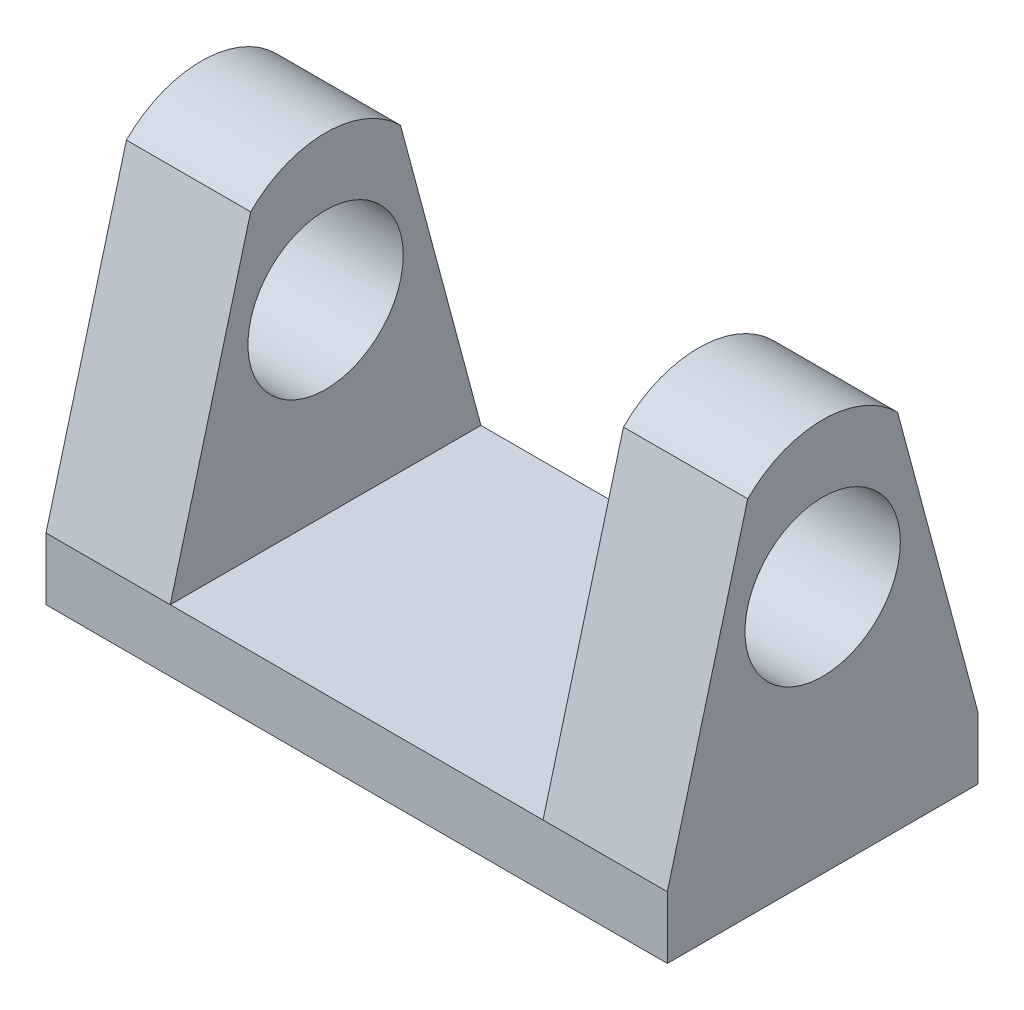
ISO-10303-21;
HEADER;
FILE_DESCRIPTION(('STEP AP214'),'2;1');
FILE_NAME('part.step','',(''),(''),'','','');
FILE_SCHEMA(('AUTOMOTIVE_DESIGN { 1 0 10303 214 1 1 1 1 }'));
ENDSEC;
DATA;
#1=APPLICATION_CONTEXT('core data for automotive mechanical design processes');
#2=APPLICATION_PROTOCOL_DEFINITION('international standard','automotive_design',2000,#1);
#3=PRODUCT_CONTEXT('',#1,'mechanical');
#4=PRODUCT('Part','Part','',(#3));
#5=PRODUCT_RELATED_PRODUCT_CATEGORY('part','',(#4));
#6=PRODUCT_DEFINITION_FORMATION('','',#4);
#7=PRODUCT_DEFINITION_CONTEXT('part definition',#1,'design');
#8=PRODUCT_DEFINITION('design','',#6,#7);
#9=PRODUCT_DEFINITION_SHAPE('','',#8);
#10=(LENGTH_UNIT() NAMED_UNIT(*) SI_UNIT(.MILLI.,.METRE.));
#11=(NAMED_UNIT(*) PLANE_ANGLE_UNIT() SI_UNIT($,.RADIAN.));
#12=(NAMED_UNIT(*) SI_UNIT($,.STERADIAN.) SOLID_ANGLE_UNIT());
#13=UNCERTAINTY_MEASURE_WITH_UNIT(LENGTH_MEASURE(1.E-05),#10,'distance_accuracy_value','');
#14=(GEOMETRIC_REPRESENTATION_CONTEXT(3) GLOBAL_UNCERTAINTY_ASSIGNED_CONTEXT((#13)) GLOBAL_UNIT_ASSIGNED_CONTEXT((#10,
#11,#12)) REPRESENTATION_CONTEXT('',''));
#15=CARTESIAN_POINT('',(0.,0.,0.));
#16=DIRECTION('',(0.,0.,1.));
#17=DIRECTION('',(1.,0.,0.));
#18=AXIS2_PLACEMENT_3D('',#15,#16,#17);
#19=CARTESIAN_POINT('',(12.7,2.54,6.34999999999997));
#20=DIRECTION('',(-1.,0.,0.));
#21=DIRECTION('',(0.,0.,1.));
#22=AXIS2_PLACEMENT_3D('',#19,#20,#21);
#23=PLANE('',#22);
#24=CARTESIAN_POINT('',(12.7,10.16,0.));
#25=DIRECTION('',(1.,0.,0.));
#26=DIRECTION('',(0.,0.,-1.));
#27=AXIS2_PLACEMENT_3D('',#24,#25,#26);
#28=CIRCLE('',#27,3.175);
#29=CARTESIAN_POINT('',(12.7,10.16,-3.175));
#30=VERTEX_POINT('',#29);
#31=EDGE_CURVE('E249',#30,#30,#28,.T.);
#32=ORIENTED_EDGE('',*,*,#31,.F.);
#33=EDGE_LOOP('',(#32));
#34=FACE_BOUND('',#33,.T.);
#35=DIRECTION('',(0.,0.,-1.));
#36=VECTOR('',#35,1.);
#37=CARTESIAN_POINT('',(12.7,0.,6.35000000000002));
#38=LINE('',#37,#36);
#39=CARTESIAN_POINT('',(12.7,0.,6.35000000000002));
#40=VERTEX_POINT('',#39);
#41=CARTESIAN_POINT('',(12.7,0.,-6.35000000000002));
#42=VERTEX_POINT('',#41);
#43=EDGE_CURVE('E176',#40,#42,#38,.T.);
#44=ORIENTED_EDGE('',*,*,#43,.T.);
#45=DIRECTION('',(0.,-1.,0.));
#46=VECTOR('',#45,1.);
#47=CARTESIAN_POINT('',(12.7,2.54,-6.35000000000002));
#48=LINE('',#47,#46);
#49=CARTESIAN_POINT('',(12.7,2.54,-6.35000000000002));
#50=VERTEX_POINT('',#49);
#51=EDGE_CURVE('E11',#50,#42,#48,.T.);
#52=ORIENTED_EDGE('',*,*,#51,.F.);
#53=DIRECTION('',(0.,0.965925826289067,0.258819045102525));
#54=VECTOR('',#53,1.);
#55=CARTESIAN_POINT('',(12.7,2.54,-6.35000000000002));
#56=LINE('',#55,#54);
#57=CARTESIAN_POINT('',(12.7,14.8072579938712,-3.06299812719796));
#58=VERTEX_POINT('',#57);
#59=EDGE_CURVE('E151',#50,#58,#56,.T.);
#60=ORIENTED_EDGE('',*,*,#59,.T.);
#61=CARTESIAN_POINT('',(12.7,11.7442598666732,0.));
#62=DIRECTION('',(1.,0.,0.));
#63=DIRECTION('',(0.,0.,1.));
#64=AXIS2_PLACEMENT_3D('',#61,#62,#63);
#65=CIRCLE('',#64,4.33173349300677);
#66=CARTESIAN_POINT('',(12.7,14.8072579938712,3.06299812719801));
#67=VERTEX_POINT('',#66);
#68=EDGE_CURVE('E169',#58,#67,#65,.T.);
#69=ORIENTED_EDGE('',*,*,#68,.T.);
#70=DIRECTION('',(0.,-0.965925826289069,0.258819045102518));
#71=VECTOR('',#70,1.);
#72=CARTESIAN_POINT('',(12.7,2.54,6.34999999999997));
#73=LINE('',#72,#71);
#74=CARTESIAN_POINT('',(12.7,2.54,6.34999999999997));
#75=VERTEX_POINT('',#74);
#76=EDGE_CURVE('E157',#67,#75,#73,.T.);
#77=ORIENTED_EDGE('',*,*,#76,.T.);
#78=DIRECTION('',(0.,-1.,0.));
#79=VECTOR('',#78,1.);
#80=CARTESIAN_POINT('',(12.7,2.54,6.34999999999997));
#81=LINE('',#80,#79);
#82=EDGE_CURVE('E186',#75,#40,#81,.T.);
#83=ORIENTED_EDGE('',*,*,#82,.T.);
#84=EDGE_LOOP('',(#44,#52,#60,#69,#77,#83));
#85=FACE_BOUND('',#84,.T.);
#86=ADVANCED_FACE('F37',(#34,#85),#23,.F.);
#87=CARTESIAN_POINT('',(-12.7,2.54000000000001,-6.35000000000002));
#88=DIRECTION('',(0.,0.,1.));
#89=DIRECTION('',(1.,0.,0.));
#90=AXIS2_PLACEMENT_3D('',#87,#88,#89);
#91=PLANE('',#90);
#92=DIRECTION('',(-1.,0.,0.));
#93=VECTOR('',#92,1.);
#94=CARTESIAN_POINT('',(-12.7,0.,-6.35000000000002));
#95=LINE('',#94,#93);
#96=CARTESIAN_POINT('',(-12.7,0.,-6.35000000000002));
#97=VERTEX_POINT('',#96);
#98=EDGE_CURVE('E189',#42,#97,#95,.T.);
#99=ORIENTED_EDGE('',*,*,#98,.T.);
#100=DIRECTION('',(0.,-1.,0.));
#101=VECTOR('',#100,1.);
#102=CARTESIAN_POINT('',(-12.7,2.54000000000001,-6.35000000000002));
#103=LINE('',#102,#101);
#104=CARTESIAN_POINT('',(-12.7,2.54000000000001,-6.35000000000002));
#105=VERTEX_POINT('',#104);
#106=EDGE_CURVE('E45',#105,#97,#103,.T.);
#107=ORIENTED_EDGE('',*,*,#106,.F.);
#108=DIRECTION('',(-1.,0.,0.));
#109=VECTOR('',#108,1.);
#110=CARTESIAN_POINT('',(-7.62,2.54000000000001,-6.35000000000002));
#111=LINE('',#110,#109);
#112=CARTESIAN_POINT('',(-7.62,2.54000000000001,-6.35000000000002));
#113=VERTEX_POINT('',#112);
#114=EDGE_CURVE('E52',#113,#105,#111,.T.);
#115=ORIENTED_EDGE('',*,*,#114,.F.);
#116=DIRECTION('',(-1.,0.,0.));
#117=VECTOR('',#116,1.);
#118=CARTESIAN_POINT('',(-12.7,2.54000000000001,-6.35000000000002));
#119=LINE('',#118,#117);
#120=CARTESIAN_POINT('',(7.61999999999999,2.54000000000001,-6.35000000000002));
#121=VERTEX_POINT('',#120);
#122=EDGE_CURVE('E184',#121,#113,#119,.T.);
#123=ORIENTED_EDGE('',*,*,#122,.F.);
#124=EDGE_CURVE('E180',#50,#121,#119,.T.);
#125=ORIENTED_EDGE('',*,*,#124,.F.);
#126=ORIENTED_EDGE('',*,*,#51,.T.);
#127=EDGE_LOOP('',(#99,#107,#115,#123,#125,#126));
#128=FACE_BOUND('',#127,.T.);
#129=ADVANCED_FACE('F229',(#128),#91,.F.);
#130=CARTESIAN_POINT('',(-12.7,2.54,6.34999999999999));
#131=DIRECTION('',(1.,0.,0.));
#132=DIRECTION('',(0.,0.,-1.));
#133=AXIS2_PLACEMENT_3D('',#130,#131,#132);
#134=PLANE('',#133);
#135=CARTESIAN_POINT('',(-12.7,10.16,0.));
#136=DIRECTION('',(1.,0.,0.));
#137=DIRECTION('',(0.,0.,-1.));
#138=AXIS2_PLACEMENT_3D('',#135,#136,#137);
#139=CIRCLE('',#138,3.175);
#140=CARTESIAN_POINT('',(-12.7,10.16,-3.175));
#141=VERTEX_POINT('',#140);
#142=EDGE_CURVE('E251',#141,#141,#139,.T.);
#143=ORIENTED_EDGE('',*,*,#142,.T.);
#144=EDGE_LOOP('',(#143));
#145=FACE_BOUND('',#144,.T.);
#146=DIRECTION('',(0.,0.,1.));
#147=VECTOR('',#146,1.);
#148=CARTESIAN_POINT('',(-12.7,0.,6.34999999999999));
#149=LINE('',#148,#147);
#150=CARTESIAN_POINT('',(-12.7,0.,6.34999999999999));
#151=VERTEX_POINT('',#150);
#152=EDGE_CURVE('E191',#97,#151,#149,.T.);
#153=ORIENTED_EDGE('',*,*,#152,.T.);
#154=DIRECTION('',(0.,-1.,0.));
#155=VECTOR('',#154,1.);
#156=CARTESIAN_POINT('',(-12.7,2.54,6.34999999999999));
#157=LINE('',#156,#155);
#158=CARTESIAN_POINT('',(-12.7,2.54,6.34999999999999));
#159=VERTEX_POINT('',#158);
#160=EDGE_CURVE('E197',#159,#151,#157,.T.);
#161=ORIENTED_EDGE('',*,*,#160,.F.);
#162=DIRECTION('',(0.,-0.965925826289069,0.258819045102518));
#163=VECTOR('',#162,1.);
#164=CARTESIAN_POINT('',(-12.7,2.54,6.34999999999999));
#165=LINE('',#164,#163);
#166=CARTESIAN_POINT('',(-12.7,14.8072579938712,3.06299812719801));
#167=VERTEX_POINT('',#166);
#168=EDGE_CURVE('E145',#167,#159,#165,.T.);
#169=ORIENTED_EDGE('',*,*,#168,.F.);
#170=CARTESIAN_POINT('',(-12.7,11.7442598666732,0.));
#171=DIRECTION('',(1.,0.,0.));
#172=DIRECTION('',(0.,0.,1.));
#173=AXIS2_PLACEMENT_3D('',#170,#171,#172);
#174=CIRCLE('',#173,4.33173349300677);
#175=CARTESIAN_POINT('',(-12.7,14.8072579938712,-3.06299812719796));
#176=VERTEX_POINT('',#175);
#177=EDGE_CURVE('E131',#176,#167,#174,.T.);
#178=ORIENTED_EDGE('',*,*,#177,.F.);
#179=DIRECTION('',(0.,0.965925826289067,0.258819045102525));
#180=VECTOR('',#179,1.);
#181=CARTESIAN_POINT('',(-12.7,2.54000000000001,-6.35000000000002));
#182=LINE('',#181,#180);
#183=EDGE_CURVE('E140',#105,#176,#182,.T.);
#184=ORIENTED_EDGE('',*,*,#183,.F.);
#185=ORIENTED_EDGE('',*,*,#106,.T.);
#186=EDGE_LOOP('',(#153,#161,#169,#178,#184,#185));
#187=FACE_BOUND('',#186,.T.);
#188=ADVANCED_FACE('F204',(#145,#187),#134,.F.);
#189=CARTESIAN_POINT('',(-12.7,2.54,6.34999999999999));
#190=DIRECTION('',(0.,0.,-1.));
#191=DIRECTION('',(-1.,0.,0.));
#192=AXIS2_PLACEMENT_3D('',#189,#190,#191);
#193=PLANE('',#192);
#194=DIRECTION('',(1.,0.,0.));
#195=VECTOR('',#194,1.);
#196=CARTESIAN_POINT('',(-12.7,0.,6.34999999999999));
#197=LINE('',#196,#195);
#198=EDGE_CURVE('E193',#151,#40,#197,.T.);
#199=ORIENTED_EDGE('',*,*,#198,.T.);
#200=ORIENTED_EDGE('',*,*,#82,.F.);
#201=DIRECTION('',(1.,0.,0.));
#202=VECTOR('',#201,1.);
#203=CARTESIAN_POINT('',(7.62,2.54000000000001,6.34999999999997));
#204=LINE('',#203,#202);
#205=CARTESIAN_POINT('',(7.62,2.54000000000001,6.34999999999997));
#206=VERTEX_POINT('',#205);
#207=EDGE_CURVE('E174',#206,#75,#204,.T.);
#208=ORIENTED_EDGE('',*,*,#207,.F.);
#209=DIRECTION('',(1.,0.,0.));
#210=VECTOR('',#209,1.);
#211=CARTESIAN_POINT('',(-12.7,2.54,6.34999999999999));
#212=LINE('',#211,#210);
#213=CARTESIAN_POINT('',(-7.62,2.54,6.34999999999999));
#214=VERTEX_POINT('',#213);
#215=EDGE_CURVE('E183',#214,#206,#212,.T.);
#216=ORIENTED_EDGE('',*,*,#215,.F.);
#217=EDGE_CURVE('E138',#159,#214,#212,.T.);
#218=ORIENTED_EDGE('',*,*,#217,.F.);
#219=ORIENTED_EDGE('',*,*,#160,.T.);
#220=EDGE_LOOP('',(#199,#200,#208,#216,#218,#219));
#221=FACE_BOUND('',#220,.T.);
#222=ADVANCED_FACE('F212',(#221),#193,.F.);
#223=CARTESIAN_POINT('',(0.,2.54000000000001,0.));
#224=DIRECTION('',(0.,-1.,0.));
#225=DIRECTION('',(0.,0.,-1.));
#226=AXIS2_PLACEMENT_3D('',#223,#224,#225);
#227=PLANE('',#226);
#228=ORIENTED_EDGE('',*,*,#122,.T.);
#229=DIRECTION('',(0.,0.,-1.));
#230=VECTOR('',#229,1.);
#231=CARTESIAN_POINT('',(-7.62,2.54,6.34999999999999));
#232=LINE('',#231,#230);
#233=EDGE_CURVE('E59',#214,#113,#232,.T.);
#234=ORIENTED_EDGE('',*,*,#233,.F.);
#235=ORIENTED_EDGE('',*,*,#215,.T.);
#236=DIRECTION('',(0.,0.,-1.));
#237=VECTOR('',#236,1.);
#238=CARTESIAN_POINT('',(7.62,2.54000000000001,6.34999999999997));
#239=LINE('',#238,#237);
#240=EDGE_CURVE('E153',#206,#121,#239,.T.);
#241=ORIENTED_EDGE('',*,*,#240,.T.);
#242=EDGE_LOOP('',(#228,#234,#235,#241));
#243=FACE_BOUND('',#242,.T.);
#244=ADVANCED_FACE('F222',(#243),#227,.F.);
#245=CARTESIAN_POINT('',(0.,0.,0.));
#246=DIRECTION('',(0.,-1.,0.));
#247=DIRECTION('',(0.,0.,-1.));
#248=AXIS2_PLACEMENT_3D('',#245,#246,#247);
#249=PLANE('',#248);
#250=ORIENTED_EDGE('',*,*,#43,.F.);
#251=ORIENTED_EDGE('',*,*,#198,.F.);
#252=ORIENTED_EDGE('',*,*,#152,.F.);
#253=ORIENTED_EDGE('',*,*,#98,.F.);
#254=EDGE_LOOP('',(#250,#251,#252,#253));
#255=FACE_BOUND('',#254,.T.);
#256=ADVANCED_FACE('F209',(#255),#249,.T.);
#257=CARTESIAN_POINT('',(7.62,2.54000000000001,6.34999999999997));
#258=DIRECTION('',(0.,0.258819045102518,0.965925826289069));
#259=DIRECTION('',(0.,-0.965925826289069,0.258819045102518));
#260=AXIS2_PLACEMENT_3D('',#257,#258,#259);
#261=PLANE('',#260);
#262=ORIENTED_EDGE('',*,*,#76,.F.);
#263=DIRECTION('',(1.,0.,0.));
#264=VECTOR('',#263,1.);
#265=CARTESIAN_POINT('',(7.62,14.8072579938712,3.06299812719801));
#266=LINE('',#265,#264);
#267=CARTESIAN_POINT('',(7.62,14.8072579938712,3.06299812719801));
#268=VERTEX_POINT('',#267);
#269=EDGE_CURVE('E177',#268,#67,#266,.T.);
#270=ORIENTED_EDGE('',*,*,#269,.F.);
#271=DIRECTION('',(0.,-0.965925826289069,0.258819045102518));
#272=VECTOR('',#271,1.);
#273=CARTESIAN_POINT('',(7.62,2.54000000000001,6.34999999999997));
#274=LINE('',#273,#272);
#275=EDGE_CURVE('E163',#268,#206,#274,.T.);
#276=ORIENTED_EDGE('',*,*,#275,.T.);
#277=ORIENTED_EDGE('',*,*,#207,.T.);
#278=EDGE_LOOP('',(#262,#270,#276,#277));
#279=FACE_BOUND('',#278,.T.);
#280=ADVANCED_FACE('F219',(#279),#261,.T.);
#281=CARTESIAN_POINT('',(7.62,11.7442598666732,0.));
#282=DIRECTION('',(1.,0.,0.));
#283=DIRECTION('',(0.,0.,-1.));
#284=AXIS2_PLACEMENT_3D('',#281,#282,#283);
#285=CYLINDRICAL_SURFACE('',#284,4.33173349300677);
#286=ORIENTED_EDGE('',*,*,#68,.F.);
#287=DIRECTION('',(1.,0.,0.));
#288=VECTOR('',#287,1.);
#289=CARTESIAN_POINT('',(7.62,14.8072579938712,-3.06299812719796));
#290=LINE('',#289,#288);
#291=CARTESIAN_POINT('',(7.62,14.8072579938712,-3.06299812719796));
#292=VERTEX_POINT('',#291);
#293=EDGE_CURVE('E166',#292,#58,#290,.T.);
#294=ORIENTED_EDGE('',*,*,#293,.F.);
#295=CARTESIAN_POINT('',(7.62,11.7442598666732,0.));
#296=DIRECTION('',(1.,0.,0.));
#297=DIRECTION('',(0.,0.,1.));
#298=AXIS2_PLACEMENT_3D('',#295,#296,#297);
#299=CIRCLE('',#298,4.33173349300677);
#300=EDGE_CURVE('E160',#292,#268,#299,.T.);
#301=ORIENTED_EDGE('',*,*,#300,.T.);
#302=ORIENTED_EDGE('',*,*,#269,.T.);
#303=EDGE_LOOP('',(#286,#294,#301,#302));
#304=FACE_BOUND('',#303,.T.);
#305=ADVANCED_FACE('F277',(#304),#285,.T.);
#306=CARTESIAN_POINT('',(7.61999999999999,2.54000000000001,-6.35000000000002));
#307=DIRECTION('',(0.,0.258819045102525,-0.965925826289067));
#308=DIRECTION('',(0.,0.965925826289067,0.258819045102525));
#309=AXIS2_PLACEMENT_3D('',#306,#307,#308);
#310=PLANE('',#309);
#311=ORIENTED_EDGE('',*,*,#59,.F.);
#312=ORIENTED_EDGE('',*,*,#124,.T.);
#313=DIRECTION('',(0.,0.965925826289067,0.258819045102525));
#314=VECTOR('',#313,1.);
#315=CARTESIAN_POINT('',(7.61999999999999,2.54000000000001,-6.35000000000002));
#316=LINE('',#315,#314);
#317=EDGE_CURVE('E156',#121,#292,#316,.T.);
#318=ORIENTED_EDGE('',*,*,#317,.T.);
#319=ORIENTED_EDGE('',*,*,#293,.T.);
#320=EDGE_LOOP('',(#311,#312,#318,#319));
#321=FACE_BOUND('',#320,.T.);
#322=ADVANCED_FACE('F228',(#321),#310,.T.);
#323=CARTESIAN_POINT('',(7.62,11.7442598666732,0.));
#324=DIRECTION('',(-1.,0.,0.));
#325=DIRECTION('',(0.,0.,1.));
#326=AXIS2_PLACEMENT_3D('',#323,#324,#325);
#327=PLANE('',#326);
#328=CARTESIAN_POINT('',(7.61999999999999,10.16,0.));
#329=DIRECTION('',(-1.,0.,0.));
#330=DIRECTION('',(0.,0.,1.));
#331=AXIS2_PLACEMENT_3D('',#328,#329,#330);
#332=CIRCLE('',#331,3.175);
#333=CARTESIAN_POINT('',(7.61999999999999,10.16,3.175));
#334=VERTEX_POINT('',#333);
#335=EDGE_CURVE('E147',#334,#334,#332,.T.);
#336=ORIENTED_EDGE('',*,*,#335,.F.);
#337=EDGE_LOOP('',(#336));
#338=FACE_BOUND('',#337,.T.);
#339=ORIENTED_EDGE('',*,*,#240,.F.);
#340=ORIENTED_EDGE('',*,*,#275,.F.);
#341=ORIENTED_EDGE('',*,*,#300,.F.);
#342=ORIENTED_EDGE('',*,*,#317,.F.);
#343=EDGE_LOOP('',(#339,#340,#341,#342));
#344=FACE_BOUND('',#343,.T.);
#345=ADVANCED_FACE('F224',(#338,#344),#327,.T.);
#346=CARTESIAN_POINT('',(-7.62,2.54000000000001,-6.35000000000002));
#347=DIRECTION('',(0.,-0.258819045102525,0.965925826289067));
#348=DIRECTION('',(0.,-0.965925826289067,-0.258819045102525));
#349=AXIS2_PLACEMENT_3D('',#346,#347,#348);
#350=PLANE('',#349);
#351=ORIENTED_EDGE('',*,*,#183,.T.);
#352=DIRECTION('',(-1.,0.,0.));
#353=VECTOR('',#352,1.);
#354=CARTESIAN_POINT('',(-7.62,14.8072579938712,-3.06299812719796));
#355=LINE('',#354,#353);
#356=CARTESIAN_POINT('',(-7.62,14.8072579938712,-3.06299812719796));
#357=VERTEX_POINT('',#356);
#358=EDGE_CURVE('E135',#357,#176,#355,.T.);
#359=ORIENTED_EDGE('',*,*,#358,.F.);
#360=DIRECTION('',(0.,0.965925826289067,0.258819045102525));
#361=VECTOR('',#360,1.);
#362=CARTESIAN_POINT('',(-7.62,2.54000000000001,-6.35000000000002));
#363=LINE('',#362,#361);
#364=EDGE_CURVE('E122',#113,#357,#363,.T.);
#365=ORIENTED_EDGE('',*,*,#364,.F.);
#366=ORIENTED_EDGE('',*,*,#114,.T.);
#367=EDGE_LOOP('',(#351,#359,#365,#366));
#368=FACE_BOUND('',#367,.T.);
#369=ADVANCED_FACE('F231',(#368),#350,.F.);
#370=CARTESIAN_POINT('',(-7.62,11.7442598666732,0.));
#371=DIRECTION('',(-1.,0.,0.));
#372=DIRECTION('',(0.,0.,1.));
#373=AXIS2_PLACEMENT_3D('',#370,#371,#372);
#374=CYLINDRICAL_SURFACE('',#373,4.33173349300677);
#375=ORIENTED_EDGE('',*,*,#177,.T.);
#376=DIRECTION('',(-1.,0.,0.));
#377=VECTOR('',#376,1.);
#378=CARTESIAN_POINT('',(-7.62,14.8072579938712,3.06299812719801));
#379=LINE('',#378,#377);
#380=CARTESIAN_POINT('',(-7.62,14.8072579938712,3.06299812719801));
#381=VERTEX_POINT('',#380);
#382=EDGE_CURVE('E128',#381,#167,#379,.T.);
#383=ORIENTED_EDGE('',*,*,#382,.F.);
#384=CARTESIAN_POINT('',(-7.62,11.7442598666732,0.));
#385=DIRECTION('',(1.,0.,0.));
#386=DIRECTION('',(0.,0.,1.));
#387=AXIS2_PLACEMENT_3D('',#384,#385,#386);
#388=CIRCLE('',#387,4.33173349300677);
#389=EDGE_CURVE('E115',#357,#381,#388,.T.);
#390=ORIENTED_EDGE('',*,*,#389,.F.);
#391=ORIENTED_EDGE('',*,*,#358,.T.);
#392=EDGE_LOOP('',(#375,#383,#390,#391));
#393=FACE_BOUND('',#392,.T.);
#394=ADVANCED_FACE('F129',(#393),#374,.T.);
#395=CARTESIAN_POINT('',(-7.62,2.54,6.34999999999999));
#396=DIRECTION('',(0.,-0.258819045102518,-0.965925826289069));
#397=DIRECTION('',(0.,0.965925826289069,-0.258819045102518));
#398=AXIS2_PLACEMENT_3D('',#395,#396,#397);
#399=PLANE('',#398);
#400=ORIENTED_EDGE('',*,*,#168,.T.);
#401=ORIENTED_EDGE('',*,*,#217,.T.);
#402=DIRECTION('',(0.,-0.965925826289069,0.258819045102518));
#403=VECTOR('',#402,1.);
#404=CARTESIAN_POINT('',(-7.62,2.54,6.34999999999999));
#405=LINE('',#404,#403);
#406=EDGE_CURVE('E119',#381,#214,#405,.T.);
#407=ORIENTED_EDGE('',*,*,#406,.F.);
#408=ORIENTED_EDGE('',*,*,#382,.T.);
#409=EDGE_LOOP('',(#400,#401,#407,#408));
#410=FACE_BOUND('',#409,.T.);
#411=ADVANCED_FACE('F137',(#410),#399,.F.);
#412=CARTESIAN_POINT('',(-7.62,11.7442598666732,0.));
#413=DIRECTION('',(1.,0.,0.));
#414=DIRECTION('',(0.,0.,1.));
#415=AXIS2_PLACEMENT_3D('',#412,#413,#414);
#416=PLANE('',#415);
#417=CARTESIAN_POINT('',(-7.62,10.16,0.));
#418=DIRECTION('',(1.,0.,0.));
#419=DIRECTION('',(0.,0.,-1.));
#420=AXIS2_PLACEMENT_3D('',#417,#418,#419);
#421=CIRCLE('',#420,3.175);
#422=CARTESIAN_POINT('',(-7.62,10.16,-3.175));
#423=VERTEX_POINT('',#422);
#424=EDGE_CURVE('E40',#423,#423,#421,.T.);
#425=ORIENTED_EDGE('',*,*,#424,.F.);
#426=EDGE_LOOP('',(#425));
#427=FACE_BOUND('',#426,.T.);
#428=ORIENTED_EDGE('',*,*,#233,.T.);
#429=ORIENTED_EDGE('',*,*,#364,.T.);
#430=ORIENTED_EDGE('',*,*,#389,.T.);
#431=ORIENTED_EDGE('',*,*,#406,.T.);
#432=EDGE_LOOP('',(#428,#429,#430,#431));
#433=FACE_BOUND('',#432,.T.);
#434=ADVANCED_FACE('F117',(#427,#433),#416,.T.);
#435=CARTESIAN_POINT('',(-12.7,10.16,0.));
#436=DIRECTION('',(1.,0.,0.));
#437=DIRECTION('',(0.,0.,-1.));
#438=AXIS2_PLACEMENT_3D('',#435,#436,#437);
#439=CYLINDRICAL_SURFACE('',#438,3.175);
#440=ORIENTED_EDGE('',*,*,#424,.T.);
#441=EDGE_LOOP('',(#440));
#442=FACE_BOUND('',#441,.T.);
#443=ORIENTED_EDGE('',*,*,#142,.F.);
#444=EDGE_LOOP('',(#443));
#445=FACE_BOUND('',#444,.T.);
#446=ADVANCED_FACE('F261',(#442,#445),#439,.F.);
#447=ORIENTED_EDGE('',*,*,#335,.T.);
#448=EDGE_LOOP('',(#447));
#449=FACE_BOUND('',#448,.T.);
#450=ORIENTED_EDGE('',*,*,#31,.T.);
#451=EDGE_LOOP('',(#450));
#452=FACE_BOUND('',#451,.T.);
#453=ADVANCED_FACE('F269',(#449,#452),#439,.F.);
#454=CLOSED_SHELL('',(#86,#129,#188,#222,#244,#256,#280,#305,#322,#345,#369,#394,#411,#434,#446,#453));
#455=MANIFOLD_SOLID_BREP('B2',#454);
#456=ADVANCED_BREP_SHAPE_REPRESENTATION('',(#18,#455),#14);
#457=SHAPE_DEFINITION_REPRESENTATION(#9,#456);
ENDSEC;
END-ISO-10303-21;
